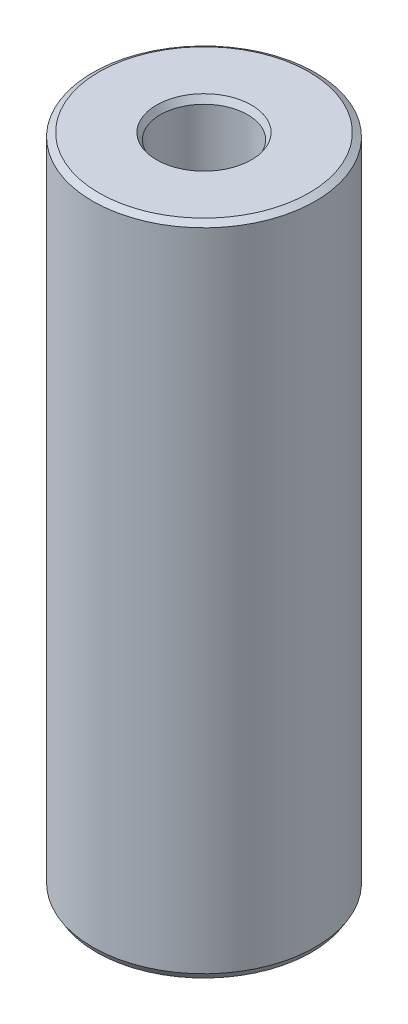
ISO-10303-21;
HEADER;
FILE_DESCRIPTION(('STEP AP214'),'2;1');
FILE_NAME('part.step','',(''),(''),'','','');
FILE_SCHEMA(('AUTOMOTIVE_DESIGN { 1 0 10303 214 1 1 1 1 }'));
ENDSEC;
DATA;
#1=APPLICATION_CONTEXT('core data for automotive mechanical design processes');
#2=APPLICATION_PROTOCOL_DEFINITION('international standard','automotive_design',2000,#1);
#3=PRODUCT_CONTEXT('',#1,'mechanical');
#4=PRODUCT('Part','Part','',(#3));
#5=PRODUCT_RELATED_PRODUCT_CATEGORY('part','',(#4));
#6=PRODUCT_DEFINITION_FORMATION('','',#4);
#7=PRODUCT_DEFINITION_CONTEXT('part definition',#1,'design');
#8=PRODUCT_DEFINITION('design','',#6,#7);
#9=PRODUCT_DEFINITION_SHAPE('','',#8);
#10=(LENGTH_UNIT() NAMED_UNIT(*) SI_UNIT(.MILLI.,.METRE.));
#11=(NAMED_UNIT(*) PLANE_ANGLE_UNIT() SI_UNIT($,.RADIAN.));
#12=(NAMED_UNIT(*) SI_UNIT($,.STERADIAN.) SOLID_ANGLE_UNIT());
#13=UNCERTAINTY_MEASURE_WITH_UNIT(LENGTH_MEASURE(1.E-05),#10,'distance_accuracy_value','');
#14=(GEOMETRIC_REPRESENTATION_CONTEXT(3) GLOBAL_UNCERTAINTY_ASSIGNED_CONTEXT((#13)) GLOBAL_UNIT_ASSIGNED_CONTEXT((#10,
#11,#12)) REPRESENTATION_CONTEXT('',''));
#15=CARTESIAN_POINT('',(0.,0.,0.));
#16=DIRECTION('',(0.,0.,1.));
#17=DIRECTION('',(1.,0.,0.));
#18=AXIS2_PLACEMENT_3D('',#15,#16,#17);
#19=CARTESIAN_POINT('',(0.,206.246052755767,0.));
#20=DIRECTION('',(0.,-1.,0.));
#21=DIRECTION('',(0.,0.,-1.));
#22=AXIS2_PLACEMENT_3D('',#19,#20,#21);
#23=CYLINDRICAL_SURFACE('',#22,35.);
#24=CARTESIAN_POINT('',(0.,2.0153846090244,0.));
#25=DIRECTION('',(0.,1.,0.));
#26=DIRECTION('',(0.,0.,1.));
#27=AXIS2_PLACEMENT_3D('',#24,#25,#26);
#28=CIRCLE('',#27,35.);
#29=CARTESIAN_POINT('',(0.,2.0153846090244,35.));
#30=VERTEX_POINT('',#29);
#31=EDGE_CURVE('E10',#30,#30,#28,.T.);
#32=ORIENTED_EDGE('',*,*,#31,.T.);
#33=EDGE_LOOP('',(#32));
#34=FACE_BOUND('',#33,.T.);
#35=CARTESIAN_POINT('',(0.,205.031163263633,0.));
#36=DIRECTION('',(0.,1.,0.));
#37=DIRECTION('',(0.,0.,1.));
#38=AXIS2_PLACEMENT_3D('',#35,#36,#37);
#39=CIRCLE('',#38,35.);
#40=CARTESIAN_POINT('',(0.,205.031163263633,35.));
#41=VERTEX_POINT('',#40);
#42=EDGE_CURVE('E50',#41,#41,#39,.F.);
#43=ORIENTED_EDGE('',*,*,#42,.T.);
#44=EDGE_LOOP('',(#43));
#45=FACE_BOUND('',#44,.T.);
#46=ADVANCED_FACE('F39',(#34,#45),#23,.T.);
#47=CARTESIAN_POINT('',(0.,206.246052755767,0.));
#48=DIRECTION('',(0.,1.,0.));
#49=DIRECTION('',(0.,0.,1.));
#50=AXIS2_PLACEMENT_3D('',#47,#48,#49);
#51=PLANE('',#50);
#52=CARTESIAN_POINT('',(0.,206.246052755767,0.));
#53=DIRECTION('',(0.,1.,0.));
#54=DIRECTION('',(0.,0.,1.));
#55=AXIS2_PLACEMENT_3D('',#52,#53,#54);
#56=CIRCLE('',#55,14.9228974669488);
#57=CARTESIAN_POINT('',(0.,206.246052755767,14.9228974669488));
#58=VERTEX_POINT('',#57);
#59=EDGE_CURVE('E58',#58,#58,#56,.F.);
#60=ORIENTED_EDGE('',*,*,#59,.T.);
#61=EDGE_LOOP('',(#60));
#62=FACE_BOUND('',#61,.T.);
#63=CARTESIAN_POINT('',(0.,206.246052755767,0.));
#64=DIRECTION('',(0.,1.,0.));
#65=DIRECTION('',(0.,0.,1.));
#66=AXIS2_PLACEMENT_3D('',#63,#64,#65);
#67=CIRCLE('',#66,32.9846153909757);
#68=CARTESIAN_POINT('',(0.,206.246052755767,32.9846153909757));
#69=VERTEX_POINT('',#68);
#70=EDGE_CURVE('E61',#69,#69,#67,.T.);
#71=ORIENTED_EDGE('',*,*,#70,.T.);
#72=EDGE_LOOP('',(#71));
#73=FACE_BOUND('',#72,.T.);
#74=ADVANCED_FACE('F88',(#62,#73),#51,.T.);
#75=CARTESIAN_POINT('',(0.,0.,0.));
#76=DIRECTION('',(0.,1.,0.));
#77=DIRECTION('',(0.,0.,1.));
#78=AXIS2_PLACEMENT_3D('',#75,#76,#77);
#79=PLANE('',#78);
#80=CARTESIAN_POINT('',(0.,0.,0.));
#81=DIRECTION('',(0.,1.,0.));
#82=DIRECTION('',(0.,0.,1.));
#83=AXIS2_PLACEMENT_3D('',#80,#81,#82);
#84=CIRCLE('',#83,15.7233925838396);
#85=CARTESIAN_POINT('',(0.,0.,15.7233925838396));
#86=VERTEX_POINT('',#85);
#87=EDGE_CURVE('E51',#86,#86,#84,.T.);
#88=ORIENTED_EDGE('',*,*,#87,.T.);
#89=EDGE_LOOP('',(#88));
#90=FACE_BOUND('',#89,.T.);
#91=CARTESIAN_POINT('',(0.,0.,0.));
#92=DIRECTION('',(0.,1.,0.));
#93=DIRECTION('',(0.,0.,1.));
#94=AXIS2_PLACEMENT_3D('',#91,#92,#93);
#95=CIRCLE('',#94,33.7851105078665);
#96=CARTESIAN_POINT('',(0.,0.,33.7851105078665));
#97=VERTEX_POINT('',#96);
#98=EDGE_CURVE('E54',#97,#97,#95,.F.);
#99=ORIENTED_EDGE('',*,*,#98,.T.);
#100=EDGE_LOOP('',(#99));
#101=FACE_BOUND('',#100,.T.);
#102=ADVANCED_FACE('F83',(#90,#101),#79,.F.);
#103=CARTESIAN_POINT('',(0.,206.246052755767,0.));
#104=DIRECTION('',(0.,-1.,0.));
#105=DIRECTION('',(0.,0.,-1.));
#106=AXIS2_PLACEMENT_3D('',#103,#104,#105);
#107=CYLINDRICAL_SURFACE('',#106,13.7080079748153);
#108=CARTESIAN_POINT('',(0.,204.230668146742,0.));
#109=DIRECTION('',(0.,1.,0.));
#110=DIRECTION('',(0.,0.,1.));
#111=AXIS2_PLACEMENT_3D('',#108,#109,#110);
#112=CIRCLE('',#111,13.7080079748153);
#113=CARTESIAN_POINT('',(0.,204.230668146742,13.7080079748153));
#114=VERTEX_POINT('',#113);
#115=EDGE_CURVE('E67',#114,#114,#112,.T.);
#116=ORIENTED_EDGE('',*,*,#115,.T.);
#117=EDGE_LOOP('',(#116));
#118=FACE_BOUND('',#117,.T.);
#119=CARTESIAN_POINT('',(0.,1.21488949213341,0.));
#120=DIRECTION('',(0.,1.,0.));
#121=DIRECTION('',(0.,0.,1.));
#122=AXIS2_PLACEMENT_3D('',#119,#120,#121);
#123=CIRCLE('',#122,13.7080079748153);
#124=CARTESIAN_POINT('',(0.,1.21488949213341,13.7080079748153));
#125=VERTEX_POINT('',#124);
#126=EDGE_CURVE('E69',#125,#125,#123,.F.);
#127=ORIENTED_EDGE('',*,*,#126,.T.);
#128=EDGE_LOOP('',(#127));
#129=FACE_BOUND('',#128,.T.);
#130=ADVANCED_FACE('F71',(#118,#129),#107,.F.);
#131=CARTESIAN_POINT('',(0.,204.230668146742,0.));
#132=DIRECTION('',(0.,1.,0.));
#133=DIRECTION('',(0.,0.,1.));
#134=AXIS2_PLACEMENT_3D('',#131,#132,#133);
#135=CONICAL_SURFACE('',#134,13.7080079748153,0.542481476350454);
#136=ORIENTED_EDGE('',*,*,#59,.F.);
#137=EDGE_LOOP('',(#136));
#138=FACE_BOUND('',#137,.T.);
#139=ORIENTED_EDGE('',*,*,#115,.F.);
#140=EDGE_LOOP('',(#139));
#141=FACE_BOUND('',#140,.T.);
#142=ADVANCED_FACE('F77',(#138,#141),#135,.F.);
#143=CARTESIAN_POINT('',(0.,0.,0.));
#144=DIRECTION('',(0.,-1.,0.));
#145=DIRECTION('',(0.,0.,-1.));
#146=AXIS2_PLACEMENT_3D('',#143,#144,#145);
#147=CONICAL_SURFACE('',#146,15.7233925838396,1.02831485044445);
#148=ORIENTED_EDGE('',*,*,#126,.F.);
#149=EDGE_LOOP('',(#148));
#150=FACE_BOUND('',#149,.T.);
#151=ORIENTED_EDGE('',*,*,#87,.F.);
#152=EDGE_LOOP('',(#151));
#153=FACE_BOUND('',#152,.T.);
#154=ADVANCED_FACE('F73',(#150,#153),#147,.F.);
#155=CARTESIAN_POINT('',(0.,2.0153846090244,0.));
#156=DIRECTION('',(0.,1.,0.));
#157=DIRECTION('',(0.,0.,1.));
#158=AXIS2_PLACEMENT_3D('',#155,#156,#157);
#159=CONICAL_SURFACE('',#158,35.,0.542481476350456);
#160=ORIENTED_EDGE('',*,*,#98,.F.);
#161=EDGE_LOOP('',(#160));
#162=FACE_BOUND('',#161,.T.);
#163=ORIENTED_EDGE('',*,*,#31,.F.);
#164=EDGE_LOOP('',(#163));
#165=FACE_BOUND('',#164,.T.);
#166=ADVANCED_FACE('F76',(#162,#165),#159,.T.);
#167=CARTESIAN_POINT('',(0.,206.246052755767,0.));
#168=DIRECTION('',(0.,-1.,0.));
#169=DIRECTION('',(0.,0.,-1.));
#170=AXIS2_PLACEMENT_3D('',#167,#168,#169);
#171=CONICAL_SURFACE('',#170,32.9846153909757,1.02831485044444);
#172=ORIENTED_EDGE('',*,*,#42,.F.);
#173=EDGE_LOOP('',(#172));
#174=FACE_BOUND('',#173,.T.);
#175=ORIENTED_EDGE('',*,*,#70,.F.);
#176=EDGE_LOOP('',(#175));
#177=FACE_BOUND('',#176,.T.);
#178=ADVANCED_FACE('F45',(#174,#177),#171,.T.);
#179=CLOSED_SHELL('',(#46,#74,#102,#130,#142,#154,#166,#178));
#180=MANIFOLD_SOLID_BREP('B2',#179);
#181=ADVANCED_BREP_SHAPE_REPRESENTATION('',(#18,#180),#14);
#182=SHAPE_DEFINITION_REPRESENTATION(#9,#181);
ENDSEC;
END-ISO-10303-21;
